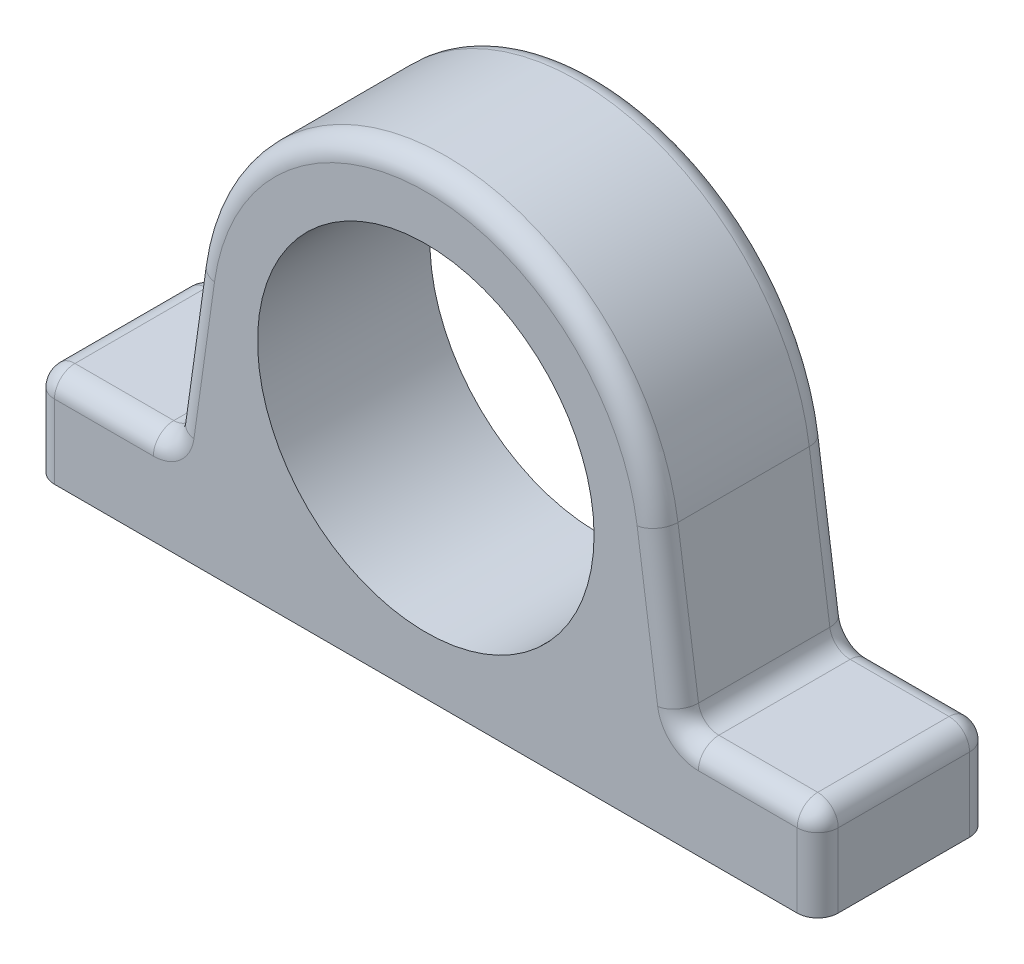
ISO-10303-21;
HEADER;
FILE_DESCRIPTION(('STEP AP214'),'2;1');
FILE_NAME('part.step','',(''),(''),'','','');
FILE_SCHEMA(('AUTOMOTIVE_DESIGN { 1 0 10303 214 1 1 1 1 }'));
ENDSEC;
DATA;
#1=APPLICATION_CONTEXT('core data for automotive mechanical design processes');
#2=APPLICATION_PROTOCOL_DEFINITION('international standard','automotive_design',2000,#1);
#3=PRODUCT_CONTEXT('',#1,'mechanical');
#4=PRODUCT('Part','Part','',(#3));
#5=PRODUCT_RELATED_PRODUCT_CATEGORY('part','',(#4));
#6=PRODUCT_DEFINITION_FORMATION('','',#4);
#7=PRODUCT_DEFINITION_CONTEXT('part definition',#1,'design');
#8=PRODUCT_DEFINITION('design','',#6,#7);
#9=PRODUCT_DEFINITION_SHAPE('','',#8);
#10=(LENGTH_UNIT() NAMED_UNIT(*) SI_UNIT(.MILLI.,.METRE.));
#11=(NAMED_UNIT(*) PLANE_ANGLE_UNIT() SI_UNIT($,.RADIAN.));
#12=(NAMED_UNIT(*) SI_UNIT($,.STERADIAN.) SOLID_ANGLE_UNIT());
#13=UNCERTAINTY_MEASURE_WITH_UNIT(LENGTH_MEASURE(1.E-05),#10,'distance_accuracy_value','');
#14=(GEOMETRIC_REPRESENTATION_CONTEXT(3) GLOBAL_UNCERTAINTY_ASSIGNED_CONTEXT((#13)) GLOBAL_UNIT_ASSIGNED_CONTEXT((#10,
#11,#12)) REPRESENTATION_CONTEXT('',''));
#15=CARTESIAN_POINT('',(0.,0.,0.));
#16=DIRECTION('',(0.,0.,1.));
#17=DIRECTION('',(1.,0.,0.));
#18=AXIS2_PLACEMENT_3D('',#15,#16,#17);
#19=CARTESIAN_POINT('',(0.,55.,42.));
#20=DIRECTION('',(0.,0.,-1.));
#21=DIRECTION('',(-1.,0.,0.));
#22=AXIS2_PLACEMENT_3D('',#19,#20,#21);
#23=CYLINDRICAL_SURFACE('',#22,41.);
#24=CARTESIAN_POINT('',(0.,55.,0.));
#25=DIRECTION('',(0.,0.,-1.));
#26=DIRECTION('',(1.,0.,0.));
#27=AXIS2_PLACEMENT_3D('',#24,#25,#26);
#28=CIRCLE('',#27,41.);
#29=CARTESIAN_POINT('',(41.,55.,0.));
#30=VERTEX_POINT('',#29);
#31=EDGE_CURVE('E202',#30,#30,#28,.T.);
#32=ORIENTED_EDGE('',*,*,#31,.T.);
#33=EDGE_LOOP('',(#32));
#34=FACE_BOUND('',#33,.T.);
#35=CARTESIAN_POINT('',(0.,55.,42.));
#36=DIRECTION('',(0.,0.,-1.));
#37=DIRECTION('',(1.,0.,0.));
#38=AXIS2_PLACEMENT_3D('',#35,#36,#37);
#39=CIRCLE('',#38,41.);
#40=CARTESIAN_POINT('',(41.,55.,42.));
#41=VERTEX_POINT('',#40);
#42=EDGE_CURVE('E201',#41,#41,#39,.T.);
#43=ORIENTED_EDGE('',*,*,#42,.F.);
#44=EDGE_LOOP('',(#43));
#45=FACE_BOUND('',#44,.T.);
#46=ADVANCED_FACE('F33',(#34,#45),#23,.F.);
#47=CARTESIAN_POINT('',(0.,55.,42.));
#48=DIRECTION('',(0.,0.,-1.));
#49=DIRECTION('',(-1.,0.,0.));
#50=AXIS2_PLACEMENT_3D('',#47,#48,#49);
#51=CYLINDRICAL_SURFACE('',#50,57.);
#52=DIRECTION('',(0.,0.,-1.));
#53=VECTOR('',#52,1.);
#54=CARTESIAN_POINT('',(-56.4452799182696,62.9328667547233,42.));
#55=LINE('',#54,#53);
#56=CARTESIAN_POINT('',(-56.4452799182696,62.9328667547233,37.));
#57=VERTEX_POINT('',#56);
#58=CARTESIAN_POINT('',(-56.4452799182696,62.9328667547233,5.00000000000001));
#59=VERTEX_POINT('',#58);
#60=EDGE_CURVE('E386',#57,#59,#55,.T.);
#61=ORIENTED_EDGE('',*,*,#60,.F.);
#62=CARTESIAN_POINT('',(0.,55.,37.));
#63=DIRECTION('',(0.,0.,-1.));
#64=DIRECTION('',(-1.,0.,0.));
#65=AXIS2_PLACEMENT_3D('',#62,#63,#64);
#66=CIRCLE('',#65,57.);
#67=CARTESIAN_POINT('',(56.4452799182705,62.9328667547225,37.));
#68=VERTEX_POINT('',#67);
#69=EDGE_CURVE('E250',#57,#68,#66,.T.);
#70=ORIENTED_EDGE('',*,*,#69,.T.);
#71=DIRECTION('',(0.,0.,-1.));
#72=VECTOR('',#71,1.);
#73=CARTESIAN_POINT('',(56.4452799182705,62.9328667547225,42.));
#74=LINE('',#73,#72);
#75=CARTESIAN_POINT('',(56.4452799182705,62.9328667547225,5.00000000000001));
#76=VERTEX_POINT('',#75);
#77=EDGE_CURVE('E366',#68,#76,#74,.T.);
#78=ORIENTED_EDGE('',*,*,#77,.T.);
#79=CARTESIAN_POINT('',(0.,55.,5.));
#80=DIRECTION('',(0.,0.,-1.));
#81=DIRECTION('',(-1.,0.,0.));
#82=AXIS2_PLACEMENT_3D('',#79,#80,#81);
#83=CIRCLE('',#82,57.);
#84=EDGE_CURVE('E248',#76,#59,#83,.F.);
#85=ORIENTED_EDGE('',*,*,#84,.T.);
#86=EDGE_LOOP('',(#61,#70,#78,#85));
#87=FACE_BOUND('',#86,.T.);
#88=ADVANCED_FACE('F474',(#87),#51,.T.);
#89=CARTESIAN_POINT('',(-56.4452799182696,62.9328667547233,42.));
#90=DIRECTION('',(0.990268068741571,-0.139173100960059,0.));
#91=DIRECTION('',(0.139173100960059,0.990268068741571,0.));
#92=AXIS2_PLACEMENT_3D('',#89,#90,#91);
#93=PLANE('',#92);
#94=DIRECTION('',(0.,0.,-1.));
#95=VECTOR('',#94,1.);
#96=CARTESIAN_POINT('',(-61.4525716894108,27.3041344951997,42.));
#97=LINE('',#96,#95);
#98=CARTESIAN_POINT('',(-61.4525716894108,27.3041344951997,5.));
#99=VERTEX_POINT('',#98);
#100=CARTESIAN_POINT('',(-61.4525716894108,27.3041344951997,37.));
#101=VERTEX_POINT('',#100);
#102=EDGE_CURVE('E269',#99,#101,#97,.F.);
#103=ORIENTED_EDGE('',*,*,#102,.T.);
#104=DIRECTION('',(-0.139173100960059,-0.990268068741571,0.));
#105=VECTOR('',#104,1.);
#106=CARTESIAN_POINT('',(-56.4452799182696,62.9328667547233,37.));
#107=LINE('',#106,#105);
#108=EDGE_CURVE('E271',#101,#57,#107,.F.);
#109=ORIENTED_EDGE('',*,*,#108,.T.);
#110=ORIENTED_EDGE('',*,*,#60,.T.);
#111=DIRECTION('',(-0.139173100960059,-0.990268068741571,0.));
#112=VECTOR('',#111,1.);
#113=CARTESIAN_POINT('',(-62.0574783440375,23.,5.));
#114=LINE('',#113,#112);
#115=EDGE_CURVE('E267',#59,#99,#114,.T.);
#116=ORIENTED_EDGE('',*,*,#115,.T.);
#117=EDGE_LOOP('',(#103,#109,#110,#116));
#118=FACE_BOUND('',#117,.T.);
#119=ADVANCED_FACE('F480',(#118),#93,.F.);
#120=CARTESIAN_POINT('',(-62.0574783440375,23.,42.));
#121=DIRECTION('',(0.,-1.,0.));
#122=DIRECTION('',(1.,0.,0.));
#123=AXIS2_PLACEMENT_3D('',#120,#121,#122);
#124=PLANE('',#123);
#125=DIRECTION('',(0.,0.,-1.));
#126=VECTOR('',#125,1.);
#127=CARTESIAN_POINT('',(-90.5,23.,42.));
#128=LINE('',#127,#126);
#129=CARTESIAN_POINT('',(-90.5,23.,5.));
#130=VERTEX_POINT('',#129);
#131=CARTESIAN_POINT('',(-90.5,23.,37.));
#132=VERTEX_POINT('',#131);
#133=EDGE_CURVE('E256',#130,#132,#128,.F.);
#134=ORIENTED_EDGE('',*,*,#133,.T.);
#135=DIRECTION('',(-1.,0.,0.));
#136=VECTOR('',#135,1.);
#137=CARTESIAN_POINT('',(-62.0574783440375,23.,37.));
#138=LINE('',#137,#136);
#139=CARTESIAN_POINT('',(-66.4039120331186,23.,37.));
#140=VERTEX_POINT('',#139);
#141=EDGE_CURVE('E258',#132,#140,#138,.F.);
#142=ORIENTED_EDGE('',*,*,#141,.T.);
#143=DIRECTION('',(0.,0.,-1.));
#144=VECTOR('',#143,1.);
#145=CARTESIAN_POINT('',(-66.4039120331186,23.,0.));
#146=LINE('',#145,#144);
#147=CARTESIAN_POINT('',(-66.4039120331186,23.,5.));
#148=VERTEX_POINT('',#147);
#149=EDGE_CURVE('E252',#140,#148,#146,.T.);
#150=ORIENTED_EDGE('',*,*,#149,.T.);
#151=DIRECTION('',(-1.,0.,0.));
#152=VECTOR('',#151,1.);
#153=CARTESIAN_POINT('',(-95.5,23.,5.));
#154=LINE('',#153,#152);
#155=EDGE_CURVE('E254',#148,#130,#154,.T.);
#156=ORIENTED_EDGE('',*,*,#155,.T.);
#157=EDGE_LOOP('',(#134,#142,#150,#156));
#158=FACE_BOUND('',#157,.T.);
#159=ADVANCED_FACE('F765',(#158),#124,.F.);
#160=CARTESIAN_POINT('',(-95.5,0.,42.));
#161=DIRECTION('',(1.,0.,0.));
#162=DIRECTION('',(0.,0.,-1.));
#163=AXIS2_PLACEMENT_3D('',#160,#161,#162);
#164=PLANE('',#163);
#165=DIRECTION('',(0.,0.,-1.));
#166=VECTOR('',#165,1.);
#167=CARTESIAN_POINT('',(-95.5,18.,42.));
#168=LINE('',#167,#166);
#169=CARTESIAN_POINT('',(-95.5,18.,37.));
#170=VERTEX_POINT('',#169);
#171=CARTESIAN_POINT('',(-95.5,18.,5.));
#172=VERTEX_POINT('',#171);
#173=EDGE_CURVE('E263',#170,#172,#168,.T.);
#174=ORIENTED_EDGE('',*,*,#173,.T.);
#175=DIRECTION('',(0.,-1.,0.));
#176=VECTOR('',#175,1.);
#177=CARTESIAN_POINT('',(-95.5,0.,5.));
#178=LINE('',#177,#176);
#179=CARTESIAN_POINT('',(-95.5,0.,5.00000000000001));
#180=VERTEX_POINT('',#179);
#181=EDGE_CURVE('E265',#172,#180,#178,.T.);
#182=ORIENTED_EDGE('',*,*,#181,.T.);
#183=DIRECTION('',(0.,0.,-1.));
#184=VECTOR('',#183,1.);
#185=CARTESIAN_POINT('',(-95.5,0.,42.));
#186=LINE('',#185,#184);
#187=CARTESIAN_POINT('',(-95.5,0.,37.));
#188=VERTEX_POINT('',#187);
#189=EDGE_CURVE('E188',#188,#180,#186,.T.);
#190=ORIENTED_EDGE('',*,*,#189,.F.);
#191=DIRECTION('',(0.,-1.,0.));
#192=VECTOR('',#191,1.);
#193=CARTESIAN_POINT('',(-95.5,0.,37.));
#194=LINE('',#193,#192);
#195=EDGE_CURVE('E261',#188,#170,#194,.F.);
#196=ORIENTED_EDGE('',*,*,#195,.T.);
#197=EDGE_LOOP('',(#174,#182,#190,#196));
#198=FACE_BOUND('',#197,.T.);
#199=ADVANCED_FACE('F739',(#198),#164,.F.);
#200=CARTESIAN_POINT('',(0.,0.,42.));
#201=DIRECTION('',(0.,1.,0.));
#202=DIRECTION('',(0.,0.,1.));
#203=AXIS2_PLACEMENT_3D('',#200,#201,#202);
#204=PLANE('',#203);
#205=DIRECTION('',(1.,0.,0.));
#206=VECTOR('',#205,1.);
#207=CARTESIAN_POINT('',(0.,0.,0.));
#208=LINE('',#207,#206);
#209=CARTESIAN_POINT('',(-90.5,0.,0.));
#210=VERTEX_POINT('',#209);
#211=CARTESIAN_POINT('',(90.5,0.,0.));
#212=VERTEX_POINT('',#211);
#213=EDGE_CURVE('E185',#210,#212,#208,.T.);
#214=ORIENTED_EDGE('',*,*,#213,.T.);
#215=CARTESIAN_POINT('',(90.5,0.,5.));
#216=DIRECTION('',(0.,1.,0.));
#217=DIRECTION('',(0.,0.,1.));
#218=AXIS2_PLACEMENT_3D('',#215,#216,#217);
#219=CIRCLE('',#218,5.);
#220=CARTESIAN_POINT('',(95.5,-1.45095770060853E-12,5.00000000000001));
#221=VERTEX_POINT('',#220);
#222=EDGE_CURVE('E275',#212,#221,#219,.F.);
#223=ORIENTED_EDGE('',*,*,#222,.T.);
#224=DIRECTION('',(0.,0.,-1.));
#225=VECTOR('',#224,1.);
#226=CARTESIAN_POINT('',(95.5,-1.45095770060853E-12,42.));
#227=LINE('',#226,#225);
#228=CARTESIAN_POINT('',(95.5,-1.45095770060853E-12,37.));
#229=VERTEX_POINT('',#228);
#230=EDGE_CURVE('E371',#229,#221,#227,.T.);
#231=ORIENTED_EDGE('',*,*,#230,.F.);
#232=CARTESIAN_POINT('',(90.5,0.,37.));
#233=DIRECTION('',(0.,1.,0.));
#234=DIRECTION('',(0.,0.,1.));
#235=AXIS2_PLACEMENT_3D('',#232,#233,#234);
#236=CIRCLE('',#235,5.);
#237=CARTESIAN_POINT('',(90.5,0.,42.));
#238=VERTEX_POINT('',#237);
#239=EDGE_CURVE('E192',#229,#238,#236,.F.);
#240=ORIENTED_EDGE('',*,*,#239,.T.);
#241=DIRECTION('',(1.,0.,0.));
#242=VECTOR('',#241,1.);
#243=CARTESIAN_POINT('',(0.,0.,42.));
#244=LINE('',#243,#242);
#245=CARTESIAN_POINT('',(-90.5,0.,42.));
#246=VERTEX_POINT('',#245);
#247=EDGE_CURVE('E380',#246,#238,#244,.T.);
#248=ORIENTED_EDGE('',*,*,#247,.F.);
#249=CARTESIAN_POINT('',(-90.5,0.,37.));
#250=DIRECTION('',(0.,1.,0.));
#251=DIRECTION('',(0.,0.,1.));
#252=AXIS2_PLACEMENT_3D('',#249,#250,#251);
#253=CIRCLE('',#252,5.);
#254=EDGE_CURVE('E193',#246,#188,#253,.F.);
#255=ORIENTED_EDGE('',*,*,#254,.T.);
#256=ORIENTED_EDGE('',*,*,#189,.T.);
#257=CARTESIAN_POINT('',(-90.5,0.,5.));
#258=DIRECTION('',(0.,1.,0.));
#259=DIRECTION('',(0.,0.,1.));
#260=AXIS2_PLACEMENT_3D('',#257,#258,#259);
#261=CIRCLE('',#260,5.);
#262=EDGE_CURVE('E182',#180,#210,#261,.F.);
#263=ORIENTED_EDGE('',*,*,#262,.T.);
#264=EDGE_LOOP('',(#214,#223,#231,#240,#248,#255,#256,#263));
#265=FACE_BOUND('',#264,.T.);
#266=ADVANCED_FACE('F184',(#265),#204,.F.);
#267=CARTESIAN_POINT('',(0.,55.,42.));
#268=DIRECTION('',(0.,0.,-1.));
#269=DIRECTION('',(-1.,0.,0.));
#270=AXIS2_PLACEMENT_3D('',#267,#268,#269);
#271=PLANE('',#270);
#272=ORIENTED_EDGE('',*,*,#42,.T.);
#273=EDGE_LOOP('',(#272));
#274=FACE_BOUND('',#273,.T.);
#275=DIRECTION('',(-1.,0.,0.));
#276=VECTOR('',#275,1.);
#277=CARTESIAN_POINT('',(0.,18.,42.));
#278=LINE('',#277,#276);
#279=CARTESIAN_POINT('',(-66.4039120331186,18.,42.));
#280=VERTEX_POINT('',#279);
#281=CARTESIAN_POINT('',(-90.5,18.,42.));
#282=VERTEX_POINT('',#281);
#283=EDGE_CURVE('E244',#280,#282,#278,.T.);
#284=ORIENTED_EDGE('',*,*,#283,.T.);
#285=DIRECTION('',(0.,-1.,0.));
#286=VECTOR('',#285,1.);
#287=CARTESIAN_POINT('',(-90.5,55.,42.));
#288=LINE('',#287,#286);
#289=EDGE_CURVE('E246',#282,#246,#288,.T.);
#290=ORIENTED_EDGE('',*,*,#289,.T.);
#291=ORIENTED_EDGE('',*,*,#247,.T.);
#292=DIRECTION('',(0.,-1.,0.));
#293=VECTOR('',#292,1.);
#294=CARTESIAN_POINT('',(90.5000000000003,22.9999999999986,42.));
#295=LINE('',#294,#293);
#296=CARTESIAN_POINT('',(90.5000000000003,17.9999999999986,42.));
#297=VERTEX_POINT('',#296);
#298=EDGE_CURVE('E235',#238,#297,#295,.F.);
#299=ORIENTED_EDGE('',*,*,#298,.T.);
#300=DIRECTION('',(1.,0.,0.));
#301=VECTOR('',#300,1.);
#302=CARTESIAN_POINT('',(62.0574783440377,17.9999999999991,42.));
#303=LINE('',#302,#301);
#304=CARTESIAN_POINT('',(66.4039120331189,17.999999999999,42.));
#305=VERTEX_POINT('',#304);
#306=EDGE_CURVE('E233',#297,#305,#303,.F.);
#307=ORIENTED_EDGE('',*,*,#306,.T.);
#308=CARTESIAN_POINT('',(66.4039120331191,27.999999999999,42.));
#309=DIRECTION('',(0.,0.,-1.));
#310=DIRECTION('',(-1.,0.,0.));
#311=AXIS2_PLACEMENT_3D('',#308,#309,#310);
#312=CIRCLE('',#311,10.);
#313=CARTESIAN_POINT('',(56.5012313457033,26.6082689903985,42.));
#314=VERTEX_POINT('',#313);
#315=EDGE_CURVE('E230',#314,#305,#312,.F.);
#316=ORIENTED_EDGE('',*,*,#315,.F.);
#317=DIRECTION('',(0.139173100960044,-0.990268068741573,0.));
#318=VECTOR('',#317,1.);
#319=CARTESIAN_POINT('',(51.4939395745627,62.2370012499223,42.));
#320=LINE('',#319,#318);
#321=CARTESIAN_POINT('',(51.4939395745627,62.2370012499223,42.));
#322=VERTEX_POINT('',#321);
#323=EDGE_CURVE('E228',#314,#322,#320,.F.);
#324=ORIENTED_EDGE('',*,*,#323,.T.);
#325=CARTESIAN_POINT('',(0.,55.,42.));
#326=DIRECTION('',(0.,0.,-1.));
#327=DIRECTION('',(-1.,0.,0.));
#328=AXIS2_PLACEMENT_3D('',#325,#326,#327);
#329=CIRCLE('',#328,52.);
#330=CARTESIAN_POINT('',(-51.4939395745618,62.237001249923,42.));
#331=VERTEX_POINT('',#330);
#332=EDGE_CURVE('E237',#322,#331,#329,.F.);
#333=ORIENTED_EDGE('',*,*,#332,.T.);
#334=DIRECTION('',(-0.139173100960059,-0.990268068741571,0.));
#335=VECTOR('',#334,1.);
#336=CARTESIAN_POINT('',(-51.4939395745617,62.2370012499231,42.));
#337=LINE('',#336,#335);
#338=CARTESIAN_POINT('',(-56.5012313457029,26.6082689903994,42.));
#339=VERTEX_POINT('',#338);
#340=EDGE_CURVE('E239',#331,#339,#337,.T.);
#341=ORIENTED_EDGE('',*,*,#340,.T.);
#342=CARTESIAN_POINT('',(-66.4039120331186,28.,42.));
#343=DIRECTION('',(0.,0.,-1.));
#344=DIRECTION('',(-1.,0.,0.));
#345=AXIS2_PLACEMENT_3D('',#342,#343,#344);
#346=CIRCLE('',#345,10.);
#347=EDGE_CURVE('E241',#280,#339,#346,.F.);
#348=ORIENTED_EDGE('',*,*,#347,.F.);
#349=EDGE_LOOP('',(#284,#290,#291,#299,#307,#316,#324,#333,#341,#348));
#350=FACE_BOUND('',#349,.T.);
#351=ADVANCED_FACE('F715',(#274,#350),#271,.F.);
#352=CARTESIAN_POINT('',(0.,55.,0.));
#353=DIRECTION('',(0.,0.,-1.));
#354=DIRECTION('',(-1.,0.,0.));
#355=AXIS2_PLACEMENT_3D('',#352,#353,#354);
#356=PLANE('',#355);
#357=ORIENTED_EDGE('',*,*,#31,.F.);
#358=EDGE_LOOP('',(#357));
#359=FACE_BOUND('',#358,.T.);
#360=DIRECTION('',(1.,0.,0.));
#361=VECTOR('',#360,1.);
#362=CARTESIAN_POINT('',(-5.65989663515554E-13,18.,0.));
#363=LINE('',#362,#361);
#364=CARTESIAN_POINT('',(66.4039120331189,17.999999999999,0.));
#365=VERTEX_POINT('',#364);
#366=CARTESIAN_POINT('',(90.5000000000003,17.9999999999986,0.));
#367=VERTEX_POINT('',#366);
#368=EDGE_CURVE('E212',#365,#367,#363,.T.);
#369=ORIENTED_EDGE('',*,*,#368,.T.);
#370=DIRECTION('',(0.,-1.,0.));
#371=VECTOR('',#370,1.);
#372=CARTESIAN_POINT('',(90.5000000000008,54.9999999999986,0.));
#373=LINE('',#372,#371);
#374=EDGE_CURVE('E200',#367,#212,#373,.T.);
#375=ORIENTED_EDGE('',*,*,#374,.T.);
#376=ORIENTED_EDGE('',*,*,#213,.F.);
#377=DIRECTION('',(0.,-1.,0.));
#378=VECTOR('',#377,1.);
#379=CARTESIAN_POINT('',(-90.5,23.,0.));
#380=LINE('',#379,#378);
#381=CARTESIAN_POINT('',(-90.5,18.,0.));
#382=VERTEX_POINT('',#381);
#383=EDGE_CURVE('E197',#210,#382,#380,.F.);
#384=ORIENTED_EDGE('',*,*,#383,.T.);
#385=DIRECTION('',(-1.,0.,0.));
#386=VECTOR('',#385,1.);
#387=CARTESIAN_POINT('',(-62.0574783440375,18.,0.));
#388=LINE('',#387,#386);
#389=CARTESIAN_POINT('',(-66.4039120331186,18.,0.));
#390=VERTEX_POINT('',#389);
#391=EDGE_CURVE('E215',#382,#390,#388,.F.);
#392=ORIENTED_EDGE('',*,*,#391,.T.);
#393=CARTESIAN_POINT('',(-66.4039120331186,28.,0.));
#394=DIRECTION('',(0.,0.,-1.));
#395=DIRECTION('',(-1.,0.,0.));
#396=AXIS2_PLACEMENT_3D('',#393,#394,#395);
#397=CIRCLE('',#396,10.);
#398=CARTESIAN_POINT('',(-56.5012313457029,26.6082689903994,0.));
#399=VERTEX_POINT('',#398);
#400=EDGE_CURVE('E393',#399,#390,#397,.T.);
#401=ORIENTED_EDGE('',*,*,#400,.F.);
#402=DIRECTION('',(-0.139173100960059,-0.990268068741571,0.));
#403=VECTOR('',#402,1.);
#404=CARTESIAN_POINT('',(-51.4939395745617,62.237001249923,0.));
#405=LINE('',#404,#403);
#406=CARTESIAN_POINT('',(-51.4939395745618,62.237001249923,0.));
#407=VERTEX_POINT('',#406);
#408=EDGE_CURVE('E391',#399,#407,#405,.F.);
#409=ORIENTED_EDGE('',*,*,#408,.T.);
#410=CARTESIAN_POINT('',(0.,55.,0.));
#411=DIRECTION('',(0.,0.,-1.));
#412=DIRECTION('',(-1.,0.,0.));
#413=AXIS2_PLACEMENT_3D('',#410,#411,#412);
#414=CIRCLE('',#413,52.);
#415=CARTESIAN_POINT('',(51.4939395745619,62.2370012499221,0.));
#416=VERTEX_POINT('',#415);
#417=EDGE_CURVE('E389',#407,#416,#414,.T.);
#418=ORIENTED_EDGE('',*,*,#417,.T.);
#419=DIRECTION('',(0.139173100960044,-0.990268068741573,0.));
#420=VECTOR('',#419,1.);
#421=CARTESIAN_POINT('',(51.4939395745626,62.2370012499224,0.));
#422=LINE('',#421,#420);
#423=CARTESIAN_POINT('',(56.5012313457033,26.6082689903985,0.));
#424=VERTEX_POINT('',#423);
#425=EDGE_CURVE('E209',#416,#424,#422,.T.);
#426=ORIENTED_EDGE('',*,*,#425,.T.);
#427=CARTESIAN_POINT('',(66.4039120331191,27.999999999999,0.));
#428=DIRECTION('',(0.,0.,-1.));
#429=DIRECTION('',(-1.,0.,0.));
#430=AXIS2_PLACEMENT_3D('',#427,#428,#429);
#431=CIRCLE('',#430,10.);
#432=EDGE_CURVE('E208',#365,#424,#431,.T.);
#433=ORIENTED_EDGE('',*,*,#432,.F.);
#434=EDGE_LOOP('',(#369,#375,#376,#384,#392,#401,#409,#418,#426,#433));
#435=FACE_BOUND('',#434,.T.);
#436=ADVANCED_FACE('F196',(#359,#435),#356,.T.);
#437=CARTESIAN_POINT('',(95.5,-1.45095770060853E-12,42.));
#438=DIRECTION('',(1.,0.,0.));
#439=DIRECTION('',(0.,1.,0.));
#440=AXIS2_PLACEMENT_3D('',#437,#438,#439);
#441=PLANE('',#440);
#442=ORIENTED_EDGE('',*,*,#230,.T.);
#443=DIRECTION('',(0.,-1.,0.));
#444=VECTOR('',#443,1.);
#445=CARTESIAN_POINT('',(95.5,-1.45095770060853E-12,5.));
#446=LINE('',#445,#444);
#447=CARTESIAN_POINT('',(95.5000000000003,17.9999999999985,5.));
#448=VERTEX_POINT('',#447);
#449=EDGE_CURVE('E281',#221,#448,#446,.F.);
#450=ORIENTED_EDGE('',*,*,#449,.T.);
#451=DIRECTION('',(0.,0.,-1.));
#452=VECTOR('',#451,1.);
#453=CARTESIAN_POINT('',(95.5000000000003,17.9999999999985,42.));
#454=LINE('',#453,#452);
#455=CARTESIAN_POINT('',(95.5000000000003,17.9999999999985,37.));
#456=VERTEX_POINT('',#455);
#457=EDGE_CURVE('E277',#448,#456,#454,.F.);
#458=ORIENTED_EDGE('',*,*,#457,.T.);
#459=DIRECTION('',(0.,-1.,0.));
#460=VECTOR('',#459,1.);
#461=CARTESIAN_POINT('',(95.5,-1.45095770060853E-12,37.));
#462=LINE('',#461,#460);
#463=EDGE_CURVE('E279',#456,#229,#462,.T.);
#464=ORIENTED_EDGE('',*,*,#463,.T.);
#465=EDGE_LOOP('',(#442,#450,#458,#464));
#466=FACE_BOUND('',#465,.T.);
#467=ADVANCED_FACE('F459',(#466),#441,.T.);
#468=CARTESIAN_POINT('',(62.0574783440378,22.999999999999,42.));
#469=DIRECTION('',(0.,1.,0.));
#470=DIRECTION('',(-1.,0.,0.));
#471=AXIS2_PLACEMENT_3D('',#468,#469,#470);
#472=PLANE('',#471);
#473=DIRECTION('',(0.,0.,-1.));
#474=VECTOR('',#473,1.);
#475=CARTESIAN_POINT('',(66.403912033119,22.999999999999,42.));
#476=LINE('',#475,#474);
#477=CARTESIAN_POINT('',(66.403912033119,22.999999999999,5.));
#478=VERTEX_POINT('',#477);
#479=CARTESIAN_POINT('',(66.403912033119,22.999999999999,37.));
#480=VERTEX_POINT('',#479);
#481=EDGE_CURVE('E53',#478,#480,#476,.F.);
#482=ORIENTED_EDGE('',*,*,#481,.T.);
#483=DIRECTION('',(1.,0.,0.));
#484=VECTOR('',#483,1.);
#485=CARTESIAN_POINT('',(95.5000000000004,22.9999999999985,37.));
#486=LINE('',#485,#484);
#487=CARTESIAN_POINT('',(90.5000000000004,22.9999999999986,37.));
#488=VERTEX_POINT('',#487);
#489=EDGE_CURVE('E11',#480,#488,#486,.T.);
#490=ORIENTED_EDGE('',*,*,#489,.T.);
#491=DIRECTION('',(0.,0.,-1.));
#492=VECTOR('',#491,1.);
#493=CARTESIAN_POINT('',(90.5000000000004,22.9999999999986,42.));
#494=LINE('',#493,#492);
#495=CARTESIAN_POINT('',(90.5000000000004,22.9999999999986,5.));
#496=VERTEX_POINT('',#495);
#497=EDGE_CURVE('E42',#488,#496,#494,.T.);
#498=ORIENTED_EDGE('',*,*,#497,.T.);
#499=DIRECTION('',(1.,0.,0.));
#500=VECTOR('',#499,1.);
#501=CARTESIAN_POINT('',(62.0574783440378,22.999999999999,5.));
#502=LINE('',#501,#500);
#503=EDGE_CURVE('E283',#496,#478,#502,.F.);
#504=ORIENTED_EDGE('',*,*,#503,.T.);
#505=EDGE_LOOP('',(#482,#490,#498,#504));
#506=FACE_BOUND('',#505,.T.);
#507=ADVANCED_FACE('F434',(#506),#472,.T.);
#508=CARTESIAN_POINT('',(56.4452799182705,62.9328667547225,42.));
#509=DIRECTION('',(0.990268068741573,0.139173100960044,0.));
#510=DIRECTION('',(-0.139173100960044,0.990268068741573,0.));
#511=AXIS2_PLACEMENT_3D('',#508,#509,#510);
#512=PLANE('',#511);
#513=DIRECTION('',(0.,0.,-1.));
#514=VECTOR('',#513,1.);
#515=CARTESIAN_POINT('',(61.4525716894112,27.3041344951988,0.));
#516=LINE('',#515,#514);
#517=CARTESIAN_POINT('',(61.4525716894112,27.3041344951988,37.));
#518=VERTEX_POINT('',#517);
#519=CARTESIAN_POINT('',(61.4525716894112,27.3041344951988,5.));
#520=VERTEX_POINT('',#519);
#521=EDGE_CURVE('E223',#518,#520,#516,.T.);
#522=ORIENTED_EDGE('',*,*,#521,.T.);
#523=DIRECTION('',(0.139173100960044,-0.990268068741573,0.));
#524=VECTOR('',#523,1.);
#525=CARTESIAN_POINT('',(56.4452799182705,62.9328667547225,5.));
#526=LINE('',#525,#524);
#527=EDGE_CURVE('E225',#520,#76,#526,.F.);
#528=ORIENTED_EDGE('',*,*,#527,.T.);
#529=ORIENTED_EDGE('',*,*,#77,.F.);
#530=DIRECTION('',(0.139173100960044,-0.990268068741573,0.));
#531=VECTOR('',#530,1.);
#532=CARTESIAN_POINT('',(62.0574783440378,22.999999999999,37.));
#533=LINE('',#532,#531);
#534=EDGE_CURVE('E221',#68,#518,#533,.T.);
#535=ORIENTED_EDGE('',*,*,#534,.T.);
#536=EDGE_LOOP('',(#522,#528,#529,#535));
#537=FACE_BOUND('',#536,.T.);
#538=ADVANCED_FACE('F684',(#537),#512,.T.);
#539=CARTESIAN_POINT('',(-90.5,55.,37.));
#540=DIRECTION('',(0.,-1.,0.));
#541=DIRECTION('',(0.,0.,-1.));
#542=AXIS2_PLACEMENT_3D('',#539,#540,#541);
#543=CYLINDRICAL_SURFACE('',#542,5.);
#544=CARTESIAN_POINT('',(-90.5,18.,37.));
#545=DIRECTION('',(0.,1.,0.));
#546=DIRECTION('',(0.,0.,1.));
#547=AXIS2_PLACEMENT_3D('',#544,#545,#546);
#548=CIRCLE('',#547,5.);
#549=EDGE_CURVE('E37',#170,#282,#548,.T.);
#550=ORIENTED_EDGE('',*,*,#549,.F.);
#551=ORIENTED_EDGE('',*,*,#195,.F.);
#552=ORIENTED_EDGE('',*,*,#254,.F.);
#553=ORIENTED_EDGE('',*,*,#289,.F.);
#554=EDGE_LOOP('',(#550,#551,#552,#553));
#555=FACE_BOUND('',#554,.T.);
#556=ADVANCED_FACE('F35',(#555),#543,.T.);
#557=CARTESIAN_POINT('',(-90.5,18.,37.));
#558=DIRECTION('',(0.,0.,1.));
#559=DIRECTION('',(1.,0.,0.));
#560=AXIS2_PLACEMENT_3D('',#557,#558,#559);
#561=SPHERICAL_SURFACE('',#560,5.);
#562=CARTESIAN_POINT('',(-90.5,18.,37.));
#563=DIRECTION('',(0.,0.,1.));
#564=DIRECTION('',(1.,0.,0.));
#565=AXIS2_PLACEMENT_3D('',#562,#563,#564);
#566=CIRCLE('',#565,5.);
#567=EDGE_CURVE('E357',#170,#132,#566,.F.);
#568=ORIENTED_EDGE('',*,*,#567,.F.);
#569=ORIENTED_EDGE('',*,*,#549,.T.);
#570=CARTESIAN_POINT('',(-90.5,18.,37.));
#571=DIRECTION('',(-1.,0.,0.));
#572=DIRECTION('',(0.,0.,1.));
#573=AXIS2_PLACEMENT_3D('',#570,#571,#572);
#574=CIRCLE('',#573,5.);
#575=EDGE_CURVE('E359',#132,#282,#574,.F.);
#576=ORIENTED_EDGE('',*,*,#575,.F.);
#577=EDGE_LOOP('',(#568,#569,#576));
#578=FACE_BOUND('',#577,.T.);
#579=ADVANCED_FACE('F670',(#578),#561,.T.);
#580=CARTESIAN_POINT('',(0.,18.,37.));
#581=DIRECTION('',(-1.,0.,0.));
#582=DIRECTION('',(0.,-1.,0.));
#583=AXIS2_PLACEMENT_3D('',#580,#581,#582);
#584=CYLINDRICAL_SURFACE('',#583,5.);
#585=ORIENTED_EDGE('',*,*,#575,.T.);
#586=ORIENTED_EDGE('',*,*,#283,.F.);
#587=CARTESIAN_POINT('',(-66.4039120331186,18.,37.));
#588=DIRECTION('',(1.,0.,0.));
#589=DIRECTION('',(0.,0.,-1.));
#590=AXIS2_PLACEMENT_3D('',#587,#588,#589);
#591=CIRCLE('',#590,5.);
#592=EDGE_CURVE('E351',#140,#280,#591,.T.);
#593=ORIENTED_EDGE('',*,*,#592,.F.);
#594=ORIENTED_EDGE('',*,*,#141,.F.);
#595=EDGE_LOOP('',(#585,#586,#593,#594));
#596=FACE_BOUND('',#595,.T.);
#597=ADVANCED_FACE('F661',(#596),#584,.T.);
#598=CARTESIAN_POINT('',(-90.5,18.,42.));
#599=DIRECTION('',(0.,0.,-1.));
#600=DIRECTION('',(-1.,0.,0.));
#601=AXIS2_PLACEMENT_3D('',#598,#599,#600);
#602=CYLINDRICAL_SURFACE('',#601,5.);
#603=ORIENTED_EDGE('',*,*,#567,.T.);
#604=ORIENTED_EDGE('',*,*,#133,.F.);
#605=CARTESIAN_POINT('',(-90.5,18.,5.));
#606=DIRECTION('',(0.,0.,-1.));
#607=DIRECTION('',(-1.,0.,0.));
#608=AXIS2_PLACEMENT_3D('',#605,#606,#607);
#609=CIRCLE('',#608,5.);
#610=EDGE_CURVE('E348',#172,#130,#609,.T.);
#611=ORIENTED_EDGE('',*,*,#610,.F.);
#612=ORIENTED_EDGE('',*,*,#173,.F.);
#613=EDGE_LOOP('',(#603,#604,#611,#612));
#614=FACE_BOUND('',#613,.T.);
#615=ADVANCED_FACE('F653',(#614),#602,.T.);
#616=CARTESIAN_POINT('',(-90.5,0.,5.));
#617=DIRECTION('',(0.,1.,0.));
#618=DIRECTION('',(0.,0.,1.));
#619=AXIS2_PLACEMENT_3D('',#616,#617,#618);
#620=CYLINDRICAL_SURFACE('',#619,5.);
#621=ORIENTED_EDGE('',*,*,#262,.F.);
#622=ORIENTED_EDGE('',*,*,#181,.F.);
#623=CARTESIAN_POINT('',(-90.5,18.,5.));
#624=DIRECTION('',(0.,1.,0.));
#625=DIRECTION('',(-1.,0.,0.));
#626=AXIS2_PLACEMENT_3D('',#623,#624,#625);
#627=CIRCLE('',#626,5.);
#628=EDGE_CURVE('E206',#382,#172,#627,.T.);
#629=ORIENTED_EDGE('',*,*,#628,.F.);
#630=ORIENTED_EDGE('',*,*,#383,.F.);
#631=EDGE_LOOP('',(#621,#622,#629,#630));
#632=FACE_BOUND('',#631,.T.);
#633=ADVANCED_FACE('F204',(#632),#620,.T.);
#634=CARTESIAN_POINT('',(90.5,-1.37499132884892E-12,37.));
#635=DIRECTION('',(0.,1.,0.));
#636=DIRECTION('',(-1.,0.,0.));
#637=AXIS2_PLACEMENT_3D('',#634,#635,#636);
#638=CYLINDRICAL_SURFACE('',#637,5.);
#639=ORIENTED_EDGE('',*,*,#239,.F.);
#640=ORIENTED_EDGE('',*,*,#463,.F.);
#641=CARTESIAN_POINT('',(90.5000000000003,17.9999999999986,37.));
#642=DIRECTION('',(0.,1.,0.));
#643=DIRECTION('',(-1.,0.,0.));
#644=AXIS2_PLACEMENT_3D('',#641,#642,#643);
#645=CIRCLE('',#644,5.);
#646=EDGE_CURVE('E344',#297,#456,#645,.T.);
#647=ORIENTED_EDGE('',*,*,#646,.F.);
#648=ORIENTED_EDGE('',*,*,#298,.F.);
#649=EDGE_LOOP('',(#639,#640,#647,#648));
#650=FACE_BOUND('',#649,.T.);
#651=ADVANCED_FACE('F456',(#650),#638,.T.);
#652=CARTESIAN_POINT('',(-51.4939395745617,62.2370012499231,37.));
#653=DIRECTION('',(-0.139173100960059,-0.990268068741571,0.));
#654=DIRECTION('',(0.990268068741571,-0.139173100960059,0.));
#655=AXIS2_PLACEMENT_3D('',#652,#653,#654);
#656=CYLINDRICAL_SURFACE('',#655,5.);
#657=CARTESIAN_POINT('',(-56.5012313457029,26.6082689903994,37.));
#658=DIRECTION('',(-0.139173100960058,-0.990268068741571,0.));
#659=DIRECTION('',(0.990268068741571,-0.139173100960058,0.));
#660=AXIS2_PLACEMENT_3D('',#657,#658,#659);
#661=CIRCLE('',#660,5.);
#662=EDGE_CURVE('E354',#339,#101,#661,.T.);
#663=ORIENTED_EDGE('',*,*,#662,.F.);
#664=ORIENTED_EDGE('',*,*,#340,.F.);
#665=CARTESIAN_POINT('',(-51.4939395745617,62.237001249923,37.));
#666=DIRECTION('',(0.139173100960059,0.990268068741571,0.));
#667=DIRECTION('',(-0.990268068741571,0.139173100960059,0.));
#668=AXIS2_PLACEMENT_3D('',#665,#666,#667);
#669=CIRCLE('',#668,5.);
#670=EDGE_CURVE('E341',#57,#331,#669,.T.);
#671=ORIENTED_EDGE('',*,*,#670,.F.);
#672=ORIENTED_EDGE('',*,*,#108,.F.);
#673=EDGE_LOOP('',(#663,#664,#671,#672));
#674=FACE_BOUND('',#673,.T.);
#675=ADVANCED_FACE('F629',(#674),#656,.T.);
#676=CARTESIAN_POINT('',(-66.4039120331186,28.,37.));
#677=DIRECTION('',(0.,0.,-1.));
#678=DIRECTION('',(-1.,0.,0.));
#679=AXIS2_PLACEMENT_3D('',#676,#677,#678);
#680=TOROIDAL_SURFACE('',#679,10.,5.);
#681=ORIENTED_EDGE('',*,*,#347,.T.);
#682=ORIENTED_EDGE('',*,*,#662,.T.);
#683=CARTESIAN_POINT('',(-66.4039120331186,28.,37.));
#684=DIRECTION('',(0.,0.,-1.));
#685=DIRECTION('',(-1.,0.,0.));
#686=AXIS2_PLACEMENT_3D('',#683,#684,#685);
#687=CIRCLE('',#686,5.);
#688=EDGE_CURVE('E338',#140,#101,#687,.F.);
#689=ORIENTED_EDGE('',*,*,#688,.F.);
#690=ORIENTED_EDGE('',*,*,#592,.T.);
#691=EDGE_LOOP('',(#681,#682,#689,#690));
#692=FACE_BOUND('',#691,.T.);
#693=ADVANCED_FACE('F620',(#692),#680,.T.);
#694=CARTESIAN_POINT('',(-90.5,18.,5.));
#695=DIRECTION('',(0.,0.,1.));
#696=DIRECTION('',(1.,0.,0.));
#697=AXIS2_PLACEMENT_3D('',#694,#695,#696);
#698=SPHERICAL_SURFACE('',#697,5.);
#699=ORIENTED_EDGE('',*,*,#628,.T.);
#700=ORIENTED_EDGE('',*,*,#610,.T.);
#701=CARTESIAN_POINT('',(-90.5,18.,5.));
#702=DIRECTION('',(-1.,0.,0.));
#703=DIRECTION('',(0.,0.,1.));
#704=AXIS2_PLACEMENT_3D('',#701,#702,#703);
#705=CIRCLE('',#704,5.);
#706=EDGE_CURVE('E335',#382,#130,#705,.F.);
#707=ORIENTED_EDGE('',*,*,#706,.F.);
#708=EDGE_LOOP('',(#699,#700,#707));
#709=FACE_BOUND('',#708,.T.);
#710=ADVANCED_FACE('F612',(#709),#698,.T.);
#711=CARTESIAN_POINT('',(90.5000000000003,17.9999999999986,37.));
#712=DIRECTION('',(0.,0.,1.));
#713=DIRECTION('',(1.,0.,0.));
#714=AXIS2_PLACEMENT_3D('',#711,#712,#713);
#715=SPHERICAL_SURFACE('',#714,5.);
#716=CARTESIAN_POINT('',(90.5000000000003,17.9999999999986,37.));
#717=DIRECTION('',(1.,0.,0.));
#718=DIRECTION('',(0.,1.,0.));
#719=AXIS2_PLACEMENT_3D('',#716,#717,#718);
#720=CIRCLE('',#719,5.);
#721=EDGE_CURVE('E330',#297,#488,#720,.F.);
#722=ORIENTED_EDGE('',*,*,#721,.F.);
#723=ORIENTED_EDGE('',*,*,#646,.T.);
#724=CARTESIAN_POINT('',(90.5000000000003,17.9999999999986,37.));
#725=DIRECTION('',(0.,0.,1.));
#726=DIRECTION('',(1.,0.,0.));
#727=AXIS2_PLACEMENT_3D('',#724,#725,#726);
#728=CIRCLE('',#727,5.);
#729=EDGE_CURVE('E332',#488,#456,#728,.F.);
#730=ORIENTED_EDGE('',*,*,#729,.F.);
#731=EDGE_LOOP('',(#722,#723,#730));
#732=FACE_BOUND('',#731,.T.);
#733=ADVANCED_FACE('F450',(#732),#715,.T.);
#734=CARTESIAN_POINT('',(0.,55.,37.));
#735=DIRECTION('',(0.,0.,-1.));
#736=DIRECTION('',(-1.,0.,0.));
#737=AXIS2_PLACEMENT_3D('',#734,#735,#736);
#738=TOROIDAL_SURFACE('',#737,52.,5.);
#739=ORIENTED_EDGE('',*,*,#670,.T.);
#740=ORIENTED_EDGE('',*,*,#332,.F.);
#741=CARTESIAN_POINT('',(51.4939395745619,62.2370012499222,37.));
#742=DIRECTION('',(0.139173100960041,-0.990268068741574,0.));
#743=DIRECTION('',(0.990268068741574,0.139173100960041,0.));
#744=AXIS2_PLACEMENT_3D('',#741,#742,#743);
#745=CIRCLE('',#744,5.);
#746=EDGE_CURVE('E327',#68,#322,#745,.T.);
#747=ORIENTED_EDGE('',*,*,#746,.F.);
#748=ORIENTED_EDGE('',*,*,#69,.F.);
#749=EDGE_LOOP('',(#739,#740,#747,#748));
#750=FACE_BOUND('',#749,.T.);
#751=ADVANCED_FACE('F595',(#750),#738,.T.);
#752=CARTESIAN_POINT('',(-66.4039120331186,28.,42.));
#753=DIRECTION('',(0.,0.,1.));
#754=DIRECTION('',(1.,0.,0.));
#755=AXIS2_PLACEMENT_3D('',#752,#753,#754);
#756=CYLINDRICAL_SURFACE('',#755,5.);
#757=ORIENTED_EDGE('',*,*,#688,.T.);
#758=ORIENTED_EDGE('',*,*,#102,.F.);
#759=CARTESIAN_POINT('',(-66.4039120331186,28.,5.));
#760=DIRECTION('',(0.,0.,-1.));
#761=DIRECTION('',(-1.,0.,0.));
#762=AXIS2_PLACEMENT_3D('',#759,#760,#761);
#763=CIRCLE('',#762,5.);
#764=EDGE_CURVE('E324',#148,#99,#763,.F.);
#765=ORIENTED_EDGE('',*,*,#764,.F.);
#766=ORIENTED_EDGE('',*,*,#149,.F.);
#767=EDGE_LOOP('',(#757,#758,#765,#766));
#768=FACE_BOUND('',#767,.T.);
#769=ADVANCED_FACE('F471',(#768),#756,.F.);
#770=CARTESIAN_POINT('',(-62.0574783440375,18.,5.));
#771=DIRECTION('',(1.,0.,0.));
#772=DIRECTION('',(0.,1.,0.));
#773=AXIS2_PLACEMENT_3D('',#770,#771,#772);
#774=CYLINDRICAL_SURFACE('',#773,5.);
#775=ORIENTED_EDGE('',*,*,#706,.T.);
#776=ORIENTED_EDGE('',*,*,#155,.F.);
#777=CARTESIAN_POINT('',(-66.4039120331186,18.,5.));
#778=DIRECTION('',(1.,0.,0.));
#779=DIRECTION('',(0.,0.,-1.));
#780=AXIS2_PLACEMENT_3D('',#777,#778,#779);
#781=CIRCLE('',#780,5.);
#782=EDGE_CURVE('E321',#390,#148,#781,.T.);
#783=ORIENTED_EDGE('',*,*,#782,.F.);
#784=ORIENTED_EDGE('',*,*,#391,.F.);
#785=EDGE_LOOP('',(#775,#776,#783,#784));
#786=FACE_BOUND('',#785,.T.);
#787=ADVANCED_FACE('F400',(#786),#774,.T.);
#788=CARTESIAN_POINT('',(90.5000000000008,54.9999999999986,5.));
#789=DIRECTION('',(0.,-1.,0.));
#790=DIRECTION('',(1.,0.,0.));
#791=AXIS2_PLACEMENT_3D('',#788,#789,#790);
#792=CYLINDRICAL_SURFACE('',#791,5.);
#793=ORIENTED_EDGE('',*,*,#222,.F.);
#794=ORIENTED_EDGE('',*,*,#374,.F.);
#795=CARTESIAN_POINT('',(90.5000000000003,17.9999999999986,5.));
#796=DIRECTION('',(0.,1.,0.));
#797=DIRECTION('',(-1.,0.,0.));
#798=AXIS2_PLACEMENT_3D('',#795,#796,#797);
#799=CIRCLE('',#798,5.);
#800=EDGE_CURVE('E318',#448,#367,#799,.T.);
#801=ORIENTED_EDGE('',*,*,#800,.F.);
#802=ORIENTED_EDGE('',*,*,#449,.F.);
#803=EDGE_LOOP('',(#793,#794,#801,#802));
#804=FACE_BOUND('',#803,.T.);
#805=ADVANCED_FACE('F463',(#804),#792,.T.);
#806=CARTESIAN_POINT('',(90.5000000000003,17.9999999999986,42.));
#807=DIRECTION('',(0.,0.,-1.));
#808=DIRECTION('',(-1.,0.,0.));
#809=AXIS2_PLACEMENT_3D('',#806,#807,#808);
#810=CYLINDRICAL_SURFACE('',#809,5.);
#811=ORIENTED_EDGE('',*,*,#729,.T.);
#812=ORIENTED_EDGE('',*,*,#457,.F.);
#813=CARTESIAN_POINT('',(90.5000000000003,17.9999999999986,5.));
#814=DIRECTION('',(0.,0.,-1.));
#815=DIRECTION('',(-1.,0.,0.));
#816=AXIS2_PLACEMENT_3D('',#813,#814,#815);
#817=CIRCLE('',#816,5.);
#818=EDGE_CURVE('E315',#496,#448,#817,.T.);
#819=ORIENTED_EDGE('',*,*,#818,.F.);
#820=ORIENTED_EDGE('',*,*,#497,.F.);
#821=EDGE_LOOP('',(#811,#812,#819,#820));
#822=FACE_BOUND('',#821,.T.);
#823=ADVANCED_FACE('F433',(#822),#810,.T.);
#824=CARTESIAN_POINT('',(62.0574783440377,17.9999999999991,37.));
#825=DIRECTION('',(-1.,0.,0.));
#826=DIRECTION('',(0.,-1.,0.));
#827=AXIS2_PLACEMENT_3D('',#824,#825,#826);
#828=CYLINDRICAL_SURFACE('',#827,5.);
#829=ORIENTED_EDGE('',*,*,#721,.T.);
#830=ORIENTED_EDGE('',*,*,#489,.F.);
#831=CARTESIAN_POINT('',(66.4039120331189,17.999999999999,37.));
#832=DIRECTION('',(-1.,0.,0.));
#833=DIRECTION('',(0.,-1.,0.));
#834=AXIS2_PLACEMENT_3D('',#831,#832,#833);
#835=CIRCLE('',#834,5.);
#836=EDGE_CURVE('E312',#305,#480,#835,.T.);
#837=ORIENTED_EDGE('',*,*,#836,.F.);
#838=ORIENTED_EDGE('',*,*,#306,.F.);
#839=EDGE_LOOP('',(#829,#830,#837,#838));
#840=FACE_BOUND('',#839,.T.);
#841=ADVANCED_FACE('F446',(#840),#828,.T.);
#842=CARTESIAN_POINT('',(51.4939395745627,62.2370012499223,37.));
#843=DIRECTION('',(-0.139173100960044,0.990268068741573,0.));
#844=DIRECTION('',(-0.990268068741573,-0.139173100960044,0.));
#845=AXIS2_PLACEMENT_3D('',#842,#843,#844);
#846=CYLINDRICAL_SURFACE('',#845,5.);
#847=ORIENTED_EDGE('',*,*,#746,.T.);
#848=ORIENTED_EDGE('',*,*,#323,.F.);
#849=CARTESIAN_POINT('',(56.5012313457033,26.6082689903985,37.));
#850=DIRECTION('',(0.139173100960044,-0.990268068741573,0.));
#851=DIRECTION('',(0.990268068741573,0.139173100960044,0.));
#852=AXIS2_PLACEMENT_3D('',#849,#850,#851);
#853=CIRCLE('',#852,5.);
#854=EDGE_CURVE('E309',#518,#314,#853,.T.);
#855=ORIENTED_EDGE('',*,*,#854,.F.);
#856=ORIENTED_EDGE('',*,*,#534,.F.);
#857=EDGE_LOOP('',(#847,#848,#855,#856));
#858=FACE_BOUND('',#857,.T.);
#859=ADVANCED_FACE('F503',(#858),#846,.T.);
#860=CARTESIAN_POINT('',(-66.4039120331186,28.,5.));
#861=DIRECTION('',(0.,0.,-1.));
#862=DIRECTION('',(-1.,0.,0.));
#863=AXIS2_PLACEMENT_3D('',#860,#861,#862);
#864=TOROIDAL_SURFACE('',#863,10.,5.);
#865=ORIENTED_EDGE('',*,*,#782,.T.);
#866=ORIENTED_EDGE('',*,*,#764,.T.);
#867=CARTESIAN_POINT('',(-56.5012313457029,26.6082689903994,5.));
#868=DIRECTION('',(-0.139173100960058,-0.990268068741571,0.));
#869=DIRECTION('',(0.990268068741571,-0.139173100960058,0.));
#870=AXIS2_PLACEMENT_3D('',#867,#868,#869);
#871=CIRCLE('',#870,5.);
#872=EDGE_CURVE('E306',#399,#99,#871,.F.);
#873=ORIENTED_EDGE('',*,*,#872,.F.);
#874=ORIENTED_EDGE('',*,*,#400,.T.);
#875=EDGE_LOOP('',(#865,#866,#873,#874));
#876=FACE_BOUND('',#875,.T.);
#877=ADVANCED_FACE('F403',(#876),#864,.T.);
#878=CARTESIAN_POINT('',(90.5000000000003,17.9999999999986,5.));
#879=DIRECTION('',(0.,0.,1.));
#880=DIRECTION('',(1.,0.,0.));
#881=AXIS2_PLACEMENT_3D('',#878,#879,#880);
#882=SPHERICAL_SURFACE('',#881,5.);
#883=ORIENTED_EDGE('',*,*,#818,.T.);
#884=ORIENTED_EDGE('',*,*,#800,.T.);
#885=CARTESIAN_POINT('',(90.5000000000003,17.9999999999986,5.));
#886=DIRECTION('',(1.,0.,0.));
#887=DIRECTION('',(0.,1.,0.));
#888=AXIS2_PLACEMENT_3D('',#885,#886,#887);
#889=CIRCLE('',#888,5.);
#890=EDGE_CURVE('E303',#496,#367,#889,.F.);
#891=ORIENTED_EDGE('',*,*,#890,.F.);
#892=EDGE_LOOP('',(#883,#884,#891));
#893=FACE_BOUND('',#892,.T.);
#894=ADVANCED_FACE('F428',(#893),#882,.T.);
#895=CARTESIAN_POINT('',(66.4039120331191,27.999999999999,37.));
#896=DIRECTION('',(0.,0.,-1.));
#897=DIRECTION('',(-1.,0.,0.));
#898=AXIS2_PLACEMENT_3D('',#895,#896,#897);
#899=TOROIDAL_SURFACE('',#898,10.,5.);
#900=ORIENTED_EDGE('',*,*,#315,.T.);
#901=ORIENTED_EDGE('',*,*,#836,.T.);
#902=CARTESIAN_POINT('',(66.4039120331191,27.999999999999,37.));
#903=DIRECTION('',(0.,0.,-1.));
#904=DIRECTION('',(-1.,0.,0.));
#905=AXIS2_PLACEMENT_3D('',#902,#903,#904);
#906=CIRCLE('',#905,5.);
#907=EDGE_CURVE('E300',#518,#480,#906,.F.);
#908=ORIENTED_EDGE('',*,*,#907,.F.);
#909=ORIENTED_EDGE('',*,*,#854,.T.);
#910=EDGE_LOOP('',(#900,#901,#908,#909));
#911=FACE_BOUND('',#910,.T.);
#912=ADVANCED_FACE('F441',(#911),#899,.T.);
#913=CARTESIAN_POINT('',(-51.4939395745617,62.237001249923,5.));
#914=DIRECTION('',(0.139173100960059,0.990268068741571,0.));
#915=DIRECTION('',(-0.990268068741571,0.139173100960059,0.));
#916=AXIS2_PLACEMENT_3D('',#913,#914,#915);
#917=CYLINDRICAL_SURFACE('',#916,5.);
#918=ORIENTED_EDGE('',*,*,#872,.T.);
#919=ORIENTED_EDGE('',*,*,#115,.F.);
#920=CARTESIAN_POINT('',(-51.4939395745617,62.237001249923,5.));
#921=DIRECTION('',(0.139173100960059,0.990268068741571,0.));
#922=DIRECTION('',(-0.990268068741571,0.139173100960059,0.));
#923=AXIS2_PLACEMENT_3D('',#920,#921,#922);
#924=CIRCLE('',#923,5.);
#925=EDGE_CURVE('E297',#407,#59,#924,.T.);
#926=ORIENTED_EDGE('',*,*,#925,.F.);
#927=ORIENTED_EDGE('',*,*,#408,.F.);
#928=EDGE_LOOP('',(#918,#919,#926,#927));
#929=FACE_BOUND('',#928,.T.);
#930=ADVANCED_FACE('F408',(#929),#917,.T.);
#931=CARTESIAN_POINT('',(-5.65989663515554E-13,18.,5.));
#932=DIRECTION('',(1.,0.,0.));
#933=DIRECTION('',(0.,1.,0.));
#934=AXIS2_PLACEMENT_3D('',#931,#932,#933);
#935=CYLINDRICAL_SURFACE('',#934,5.);
#936=ORIENTED_EDGE('',*,*,#890,.T.);
#937=ORIENTED_EDGE('',*,*,#368,.F.);
#938=CARTESIAN_POINT('',(66.4039120331189,17.999999999999,5.));
#939=DIRECTION('',(-1.,0.,0.));
#940=DIRECTION('',(0.,-1.,0.));
#941=AXIS2_PLACEMENT_3D('',#938,#939,#940);
#942=CIRCLE('',#941,5.);
#943=EDGE_CURVE('E294',#478,#365,#942,.T.);
#944=ORIENTED_EDGE('',*,*,#943,.F.);
#945=ORIENTED_EDGE('',*,*,#503,.F.);
#946=EDGE_LOOP('',(#936,#937,#944,#945));
#947=FACE_BOUND('',#946,.T.);
#948=ADVANCED_FACE('F424',(#947),#935,.T.);
#949=CARTESIAN_POINT('',(66.4039120331191,27.999999999999,42.));
#950=DIRECTION('',(0.,0.,1.));
#951=DIRECTION('',(1.,0.,0.));
#952=AXIS2_PLACEMENT_3D('',#949,#950,#951);
#953=CYLINDRICAL_SURFACE('',#952,5.);
#954=ORIENTED_EDGE('',*,*,#907,.T.);
#955=ORIENTED_EDGE('',*,*,#481,.F.);
#956=CARTESIAN_POINT('',(66.4039120331191,27.999999999999,5.));
#957=DIRECTION('',(0.,0.,-1.));
#958=DIRECTION('',(-1.,0.,0.));
#959=AXIS2_PLACEMENT_3D('',#956,#957,#958);
#960=CIRCLE('',#959,5.);
#961=EDGE_CURVE('E291',#520,#478,#960,.F.);
#962=ORIENTED_EDGE('',*,*,#961,.F.);
#963=ORIENTED_EDGE('',*,*,#521,.F.);
#964=EDGE_LOOP('',(#954,#955,#962,#963));
#965=FACE_BOUND('',#964,.T.);
#966=ADVANCED_FACE('F437',(#965),#953,.F.);
#967=CARTESIAN_POINT('',(0.,55.,5.));
#968=DIRECTION('',(0.,0.,-1.));
#969=DIRECTION('',(-1.,0.,0.));
#970=AXIS2_PLACEMENT_3D('',#967,#968,#969);
#971=TOROIDAL_SURFACE('',#970,52.,5.);
#972=ORIENTED_EDGE('',*,*,#925,.T.);
#973=ORIENTED_EDGE('',*,*,#84,.F.);
#974=CARTESIAN_POINT('',(51.4939395745619,62.2370012499221,5.));
#975=DIRECTION('',(0.139173100960043,-0.990268068741573,0.));
#976=DIRECTION('',(0.990268068741574,0.139173100960043,0.));
#977=AXIS2_PLACEMENT_3D('',#974,#975,#976);
#978=CIRCLE('',#977,5.);
#979=EDGE_CURVE('E289',#416,#76,#978,.T.);
#980=ORIENTED_EDGE('',*,*,#979,.F.);
#981=ORIENTED_EDGE('',*,*,#417,.F.);
#982=EDGE_LOOP('',(#972,#973,#980,#981));
#983=FACE_BOUND('',#982,.T.);
#984=ADVANCED_FACE('F414',(#983),#971,.T.);
#985=CARTESIAN_POINT('',(66.4039120331191,27.999999999999,5.));
#986=DIRECTION('',(0.,0.,-1.));
#987=DIRECTION('',(-1.,0.,0.));
#988=AXIS2_PLACEMENT_3D('',#985,#986,#987);
#989=TOROIDAL_SURFACE('',#988,10.,5.);
#990=ORIENTED_EDGE('',*,*,#943,.T.);
#991=ORIENTED_EDGE('',*,*,#432,.T.);
#992=CARTESIAN_POINT('',(56.5012313457033,26.6082689903985,5.));
#993=DIRECTION('',(0.139173100960044,-0.990268068741573,0.));
#994=DIRECTION('',(0.990268068741573,0.139173100960044,0.));
#995=AXIS2_PLACEMENT_3D('',#992,#993,#994);
#996=CIRCLE('',#995,5.);
#997=EDGE_CURVE('E287',#520,#424,#996,.F.);
#998=ORIENTED_EDGE('',*,*,#997,.F.);
#999=ORIENTED_EDGE('',*,*,#961,.T.);
#1000=EDGE_LOOP('',(#990,#991,#998,#999));
#1001=FACE_BOUND('',#1000,.T.);
#1002=ADVANCED_FACE('F420',(#1001),#989,.T.);
#1003=CARTESIAN_POINT('',(51.4939395745626,62.2370012499224,5.));
#1004=DIRECTION('',(0.139173100960044,-0.990268068741573,0.));
#1005=DIRECTION('',(0.990268068741573,0.139173100960044,0.));
#1006=AXIS2_PLACEMENT_3D('',#1003,#1004,#1005);
#1007=CYLINDRICAL_SURFACE('',#1006,5.);
#1008=ORIENTED_EDGE('',*,*,#979,.T.);
#1009=ORIENTED_EDGE('',*,*,#527,.F.);
#1010=ORIENTED_EDGE('',*,*,#997,.T.);
#1011=ORIENTED_EDGE('',*,*,#425,.F.);
#1012=EDGE_LOOP('',(#1008,#1009,#1010,#1011));
#1013=FACE_BOUND('',#1012,.T.);
#1014=ADVANCED_FACE('F417',(#1013),#1007,.T.);
#1015=CLOSED_SHELL('',(#46,#88,#119,#159,#199,#266,#351,#436,#467,#507,#538,#556,#579,#597,#615,
#633,#651,#675,#693,#710,#733,#751,#769,#787,#805,#823,#841,#859,#877,#894,#912,#930,#948,#966,
#984,#1002,#1014));
#1016=MANIFOLD_SOLID_BREP('B2',#1015);
#1017=ADVANCED_BREP_SHAPE_REPRESENTATION('',(#18,#1016),#14);
#1018=SHAPE_DEFINITION_REPRESENTATION(#9,#1017);
ENDSEC;
END-ISO-10303-21;
